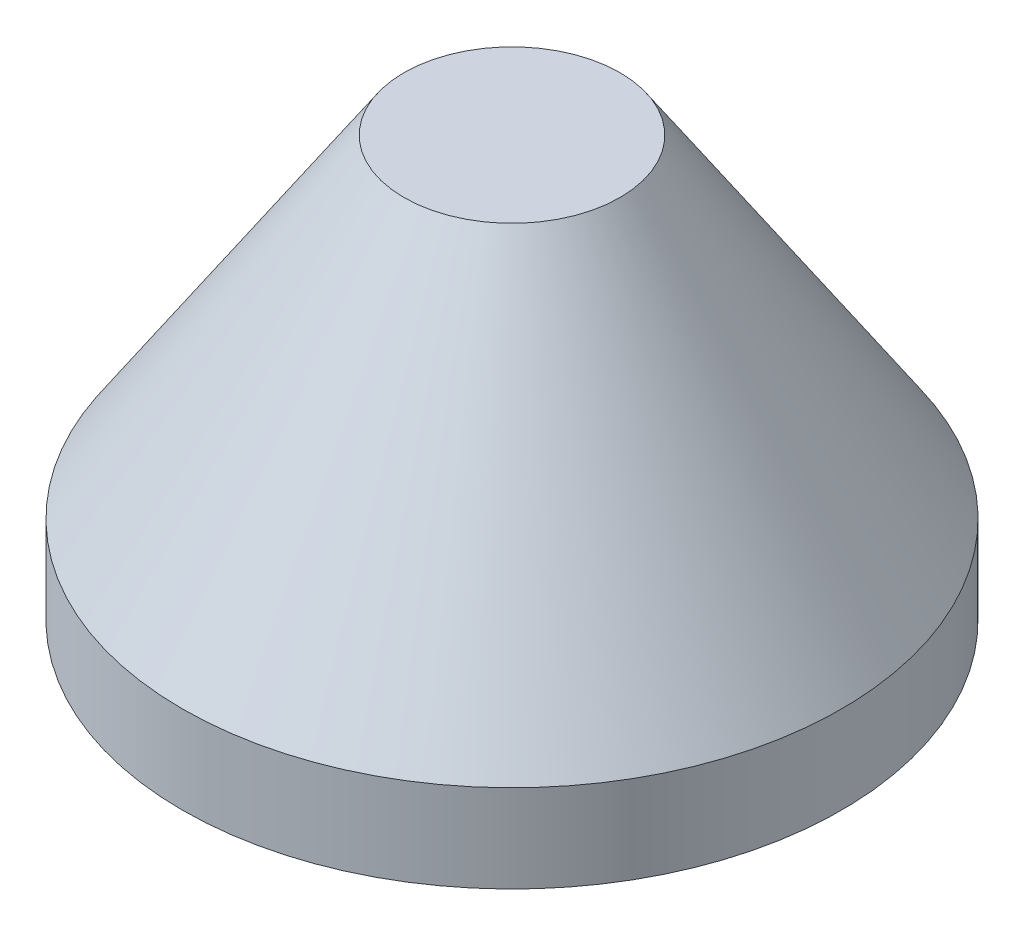
ISO-10303-21;
HEADER;
FILE_DESCRIPTION(('STEP AP214'),'2;1');
FILE_NAME('part.step','',(''),(''),'','','');
FILE_SCHEMA(('AUTOMOTIVE_DESIGN { 1 0 10303 214 1 1 1 1 }'));
ENDSEC;
DATA;
#1=APPLICATION_CONTEXT('core data for automotive mechanical design processes');
#2=APPLICATION_PROTOCOL_DEFINITION('international standard','automotive_design',2000,#1);
#3=PRODUCT_CONTEXT('',#1,'mechanical');
#4=PRODUCT('Part','Part','',(#3));
#5=PRODUCT_RELATED_PRODUCT_CATEGORY('part','',(#4));
#6=PRODUCT_DEFINITION_FORMATION('','',#4);
#7=PRODUCT_DEFINITION_CONTEXT('part definition',#1,'design');
#8=PRODUCT_DEFINITION('design','',#6,#7);
#9=PRODUCT_DEFINITION_SHAPE('','',#8);
#10=(LENGTH_UNIT() NAMED_UNIT(*) SI_UNIT(.MILLI.,.METRE.));
#11=(NAMED_UNIT(*) PLANE_ANGLE_UNIT() SI_UNIT($,.RADIAN.));
#12=(NAMED_UNIT(*) SI_UNIT($,.STERADIAN.) SOLID_ANGLE_UNIT());
#13=UNCERTAINTY_MEASURE_WITH_UNIT(LENGTH_MEASURE(1.E-05),#10,'distance_accuracy_value','');
#14=(GEOMETRIC_REPRESENTATION_CONTEXT(3) GLOBAL_UNCERTAINTY_ASSIGNED_CONTEXT((#13)) GLOBAL_UNIT_ASSIGNED_CONTEXT((#10,
#11,#12)) REPRESENTATION_CONTEXT('',''));
#15=CARTESIAN_POINT('',(0.,0.,0.));
#16=DIRECTION('',(0.,0.,1.));
#17=DIRECTION('',(1.,0.,0.));
#18=AXIS2_PLACEMENT_3D('',#15,#16,#17);
#19=CARTESIAN_POINT('',(0.,0.,-92.2655));
#20=DIRECTION('',(0.,1.,0.));
#21=DIRECTION('',(0.,0.,1.));
#22=AXIS2_PLACEMENT_3D('',#19,#20,#21);
#23=PLANE('',#22);
#24=CARTESIAN_POINT('',(0.,0.,0.));
#25=DIRECTION('',(0.,1.,0.));
#26=DIRECTION('',(0.,0.,1.));
#27=AXIS2_PLACEMENT_3D('',#24,#25,#26);
#28=CIRCLE('',#27,95.4405);
#29=CARTESIAN_POINT('',(0.,0.,95.4405));
#30=VERTEX_POINT('',#29);
#31=EDGE_CURVE('E10',#30,#30,#28,.T.);
#32=ORIENTED_EDGE('',*,*,#31,.F.);
#33=EDGE_LOOP('',(#32));
#34=FACE_BOUND('',#33,.T.);
#35=CARTESIAN_POINT('',(0.,0.,0.));
#36=DIRECTION('',(0.,1.,0.));
#37=DIRECTION('',(0.,0.,1.));
#38=AXIS2_PLACEMENT_3D('',#35,#36,#37);
#39=CIRCLE('',#38,92.2655);
#40=CARTESIAN_POINT('',(0.,0.,92.2655));
#41=VERTEX_POINT('',#40);
#42=EDGE_CURVE('E52',#41,#41,#39,.T.);
#43=ORIENTED_EDGE('',*,*,#42,.T.);
#44=EDGE_LOOP('',(#43));
#45=FACE_BOUND('',#44,.T.);
#46=ADVANCED_FACE('F30',(#34,#45),#23,.F.);
#47=CARTESIAN_POINT('',(0.,171.857284175992,0.));
#48=DIRECTION('',(0.,1.,0.));
#49=DIRECTION('',(0.,0.,1.));
#50=AXIS2_PLACEMENT_3D('',#47,#48,#49);
#51=CYLINDRICAL_SURFACE('',#50,95.4405);
#52=CARTESIAN_POINT('',(0.,25.4,0.));
#53=DIRECTION('',(0.,1.,0.));
#54=DIRECTION('',(0.,0.,1.));
#55=AXIS2_PLACEMENT_3D('',#52,#53,#54);
#56=CIRCLE('',#55,95.4405);
#57=CARTESIAN_POINT('',(0.,25.4,95.4405));
#58=VERTEX_POINT('',#57);
#59=EDGE_CURVE('E36',#58,#58,#56,.T.);
#60=ORIENTED_EDGE('',*,*,#59,.F.);
#61=EDGE_LOOP('',(#60));
#62=FACE_BOUND('',#61,.T.);
#63=ORIENTED_EDGE('',*,*,#31,.T.);
#64=EDGE_LOOP('',(#63));
#65=FACE_BOUND('',#64,.T.);
#66=ADVANCED_FACE('F80',(#62,#65),#51,.T.);
#67=CARTESIAN_POINT('',(0.,25.4,0.));
#68=DIRECTION('',(0.,-1.,0.));
#69=DIRECTION('',(0.,0.,-1.));
#70=AXIS2_PLACEMENT_3D('',#67,#68,#69);
#71=CONICAL_SURFACE('',#70,95.4405,0.587999557163321);
#72=CARTESIAN_POINT('',(0.,121.60504,0.));
#73=DIRECTION('',(0.,1.,0.));
#74=DIRECTION('',(0.,0.,1.));
#75=AXIS2_PLACEMENT_3D('',#72,#73,#74);
#76=CIRCLE('',#75,31.30423);
#77=CARTESIAN_POINT('',(0.,121.60504,31.30423));
#78=VERTEX_POINT('',#77);
#79=EDGE_CURVE('E40',#78,#78,#76,.T.);
#80=ORIENTED_EDGE('',*,*,#79,.F.);
#81=EDGE_LOOP('',(#80));
#82=FACE_BOUND('',#81,.T.);
#83=ORIENTED_EDGE('',*,*,#59,.T.);
#84=EDGE_LOOP('',(#83));
#85=FACE_BOUND('',#84,.T.);
#86=ADVANCED_FACE('F76',(#82,#85),#71,.T.);
#87=CARTESIAN_POINT('',(0.,121.60504,0.));
#88=DIRECTION('',(0.,-1.,0.));
#89=DIRECTION('',(0.,0.,-1.));
#90=AXIS2_PLACEMENT_3D('',#87,#88,#89);
#91=PLANE('',#90);
#92=ORIENTED_EDGE('',*,*,#79,.T.);
#93=EDGE_LOOP('',(#92));
#94=FACE_BOUND('',#93,.T.);
#95=ADVANCED_FACE('F71',(#94),#91,.F.);
#96=CARTESIAN_POINT('',(0.,118.43004,0.));
#97=DIRECTION('',(0.,1.,0.));
#98=DIRECTION('',(0.,0.,1.));
#99=AXIS2_PLACEMENT_3D('',#96,#97,#98);
#100=PLANE('',#99);
#101=CARTESIAN_POINT('',(0.,118.43004,0.));
#102=DIRECTION('',(0.,1.,0.));
#103=DIRECTION('',(0.,0.,1.));
#104=AXIS2_PLACEMENT_3D('',#101,#102,#103);
#105=CIRCLE('',#104,28.9675867539309);
#106=CARTESIAN_POINT('',(0.,118.43004,28.9675867539309));
#107=VERTEX_POINT('',#106);
#108=EDGE_CURVE('E44',#107,#107,#105,.T.);
#109=ORIENTED_EDGE('',*,*,#108,.F.);
#110=EDGE_LOOP('',(#109));
#111=FACE_BOUND('',#110,.T.);
#112=ADVANCED_FACE('F66',(#111),#100,.F.);
#113=CARTESIAN_POINT('',(0.,118.43004,0.));
#114=DIRECTION('',(0.,-1.,0.));
#115=DIRECTION('',(0.,0.,-1.));
#116=AXIS2_PLACEMENT_3D('',#113,#114,#115);
#117=CONICAL_SURFACE('',#116,28.9675867539309,0.587999557163314);
#118=CARTESIAN_POINT('',(0.,23.4825434312924,0.));
#119=DIRECTION('',(0.,1.,0.));
#120=DIRECTION('',(0.,0.,1.));
#121=AXIS2_PLACEMENT_3D('',#118,#119,#120);
#122=CIRCLE('',#121,92.2655);
#123=CARTESIAN_POINT('',(0.,23.4825434312924,92.2655));
#124=VERTEX_POINT('',#123);
#125=EDGE_CURVE('E49',#124,#124,#122,.T.);
#126=ORIENTED_EDGE('',*,*,#125,.F.);
#127=EDGE_LOOP('',(#126));
#128=FACE_BOUND('',#127,.T.);
#129=ORIENTED_EDGE('',*,*,#108,.T.);
#130=EDGE_LOOP('',(#129));
#131=FACE_BOUND('',#130,.T.);
#132=ADVANCED_FACE('F60',(#128,#131),#117,.F.);
#133=CARTESIAN_POINT('',(0.,171.857284175992,0.));
#134=DIRECTION('',(0.,1.,0.));
#135=DIRECTION('',(0.,0.,1.));
#136=AXIS2_PLACEMENT_3D('',#133,#134,#135);
#137=CYLINDRICAL_SURFACE('',#136,92.2655);
#138=ORIENTED_EDGE('',*,*,#42,.F.);
#139=EDGE_LOOP('',(#138));
#140=FACE_BOUND('',#139,.T.);
#141=ORIENTED_EDGE('',*,*,#125,.T.);
#142=EDGE_LOOP('',(#141));
#143=FACE_BOUND('',#142,.T.);
#144=ADVANCED_FACE('F57',(#140,#143),#137,.F.);
#145=CLOSED_SHELL('',(#46,#66,#86,#95,#112,#132,#144));
#146=MANIFOLD_SOLID_BREP('B2',#145);
#147=ADVANCED_BREP_SHAPE_REPRESENTATION('',(#18,#146),#14);
#148=SHAPE_DEFINITION_REPRESENTATION(#9,#147);
ENDSEC;
END-ISO-10303-21;
